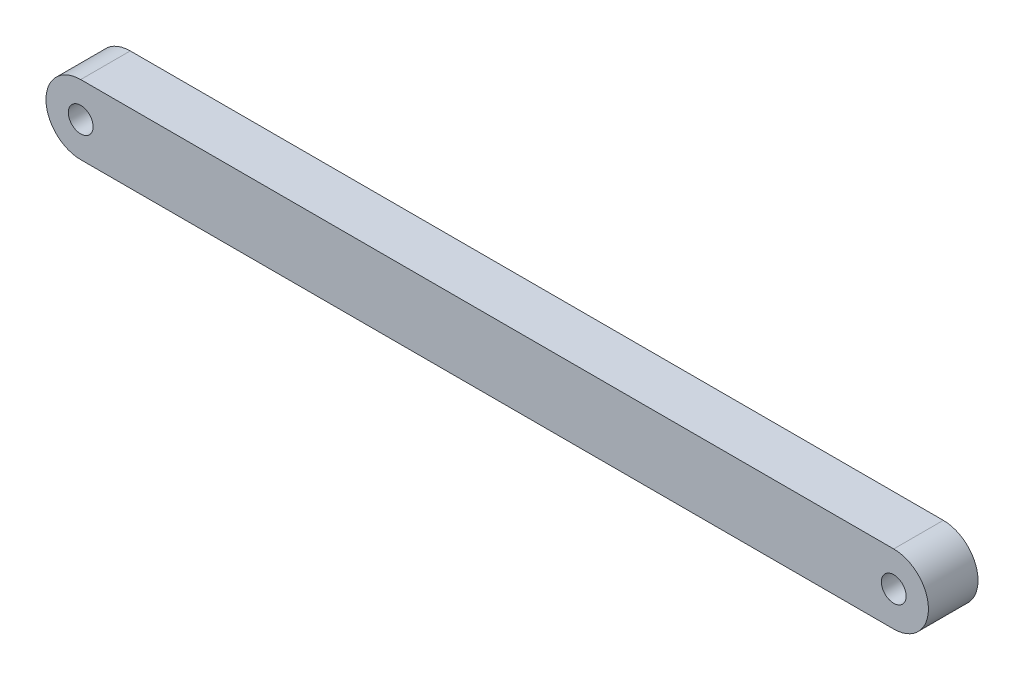
ISO-10303-21;
HEADER;
FILE_DESCRIPTION(('STEP AP214'),'2;1');
FILE_NAME('part.step','',(''),(''),'','','');
FILE_SCHEMA(('AUTOMOTIVE_DESIGN { 1 0 10303 214 1 1 1 1 }'));
ENDSEC;
DATA;
#1=APPLICATION_CONTEXT('core data for automotive mechanical design processes');
#2=APPLICATION_PROTOCOL_DEFINITION('international standard','automotive_design',2000,#1);
#3=PRODUCT_CONTEXT('',#1,'mechanical');
#4=PRODUCT('Part','Part','',(#3));
#5=PRODUCT_RELATED_PRODUCT_CATEGORY('part','',(#4));
#6=PRODUCT_DEFINITION_FORMATION('','',#4);
#7=PRODUCT_DEFINITION_CONTEXT('part definition',#1,'design');
#8=PRODUCT_DEFINITION('design','',#6,#7);
#9=PRODUCT_DEFINITION_SHAPE('','',#8);
#10=(LENGTH_UNIT() NAMED_UNIT(*) SI_UNIT(.MILLI.,.METRE.));
#11=(NAMED_UNIT(*) PLANE_ANGLE_UNIT() SI_UNIT($,.RADIAN.));
#12=(NAMED_UNIT(*) SI_UNIT($,.STERADIAN.) SOLID_ANGLE_UNIT());
#13=UNCERTAINTY_MEASURE_WITH_UNIT(LENGTH_MEASURE(1.E-05),#10,'distance_accuracy_value','');
#14=(GEOMETRIC_REPRESENTATION_CONTEXT(3) GLOBAL_UNCERTAINTY_ASSIGNED_CONTEXT((#13)) GLOBAL_UNIT_ASSIGNED_CONTEXT((#10,
#11,#12)) REPRESENTATION_CONTEXT('',''));
#15=CARTESIAN_POINT('',(0.,0.,0.));
#16=DIRECTION('',(0.,0.,1.));
#17=DIRECTION('',(1.,0.,0.));
#18=AXIS2_PLACEMENT_3D('',#15,#16,#17);
#19=CARTESIAN_POINT('',(0.,0.,5.));
#20=DIRECTION('',(0.,0.,1.));
#21=DIRECTION('',(1.,0.,0.));
#22=AXIS2_PLACEMENT_3D('',#19,#20,#21);
#23=PLANE('',#22);
#24=CARTESIAN_POINT('',(0.,0.,5.));
#25=DIRECTION('',(0.,0.,1.));
#26=DIRECTION('',(1.,0.,0.));
#27=AXIS2_PLACEMENT_3D('',#24,#25,#26);
#28=CIRCLE('',#27,2.5);
#29=CARTESIAN_POINT('',(2.5,0.,5.));
#30=VERTEX_POINT('',#29);
#31=EDGE_CURVE('E118',#30,#30,#28,.T.);
#32=ORIENTED_EDGE('',*,*,#31,.F.);
#33=EDGE_LOOP('',(#32));
#34=FACE_BOUND('',#33,.T.);
#35=CARTESIAN_POINT('',(0.,0.,5.));
#36=DIRECTION('',(0.,0.,1.));
#37=DIRECTION('',(1.,0.,0.));
#38=AXIS2_PLACEMENT_3D('',#35,#36,#37);
#39=CIRCLE('',#38,7.);
#40=CARTESIAN_POINT('',(0.,7.,5.));
#41=VERTEX_POINT('',#40);
#42=CARTESIAN_POINT('',(0.,-7.,5.));
#43=VERTEX_POINT('',#42);
#44=EDGE_CURVE('E98',#41,#43,#39,.T.);
#45=ORIENTED_EDGE('',*,*,#44,.T.);
#46=DIRECTION('',(1.,0.,0.));
#47=VECTOR('',#46,1.);
#48=CARTESIAN_POINT('',(0.,-7.,5.));
#49=LINE('',#48,#47);
#50=CARTESIAN_POINT('',(164.,-7.,5.));
#51=VERTEX_POINT('',#50);
#52=EDGE_CURVE('E93',#43,#51,#49,.T.);
#53=ORIENTED_EDGE('',*,*,#52,.T.);
#54=CARTESIAN_POINT('',(164.,0.,5.));
#55=DIRECTION('',(0.,0.,1.));
#56=DIRECTION('',(1.,0.,0.));
#57=AXIS2_PLACEMENT_3D('',#54,#55,#56);
#58=CIRCLE('',#57,7.);
#59=CARTESIAN_POINT('',(164.,7.,5.));
#60=VERTEX_POINT('',#59);
#61=EDGE_CURVE('E96',#51,#60,#58,.T.);
#62=ORIENTED_EDGE('',*,*,#61,.T.);
#63=DIRECTION('',(-1.,0.,0.));
#64=VECTOR('',#63,1.);
#65=CARTESIAN_POINT('',(0.,7.,5.));
#66=LINE('',#65,#64);
#67=EDGE_CURVE('E63',#60,#41,#66,.T.);
#68=ORIENTED_EDGE('',*,*,#67,.T.);
#69=EDGE_LOOP('',(#45,#53,#62,#68));
#70=FACE_BOUND('',#69,.T.);
#71=CARTESIAN_POINT('',(164.,0.,5.));
#72=DIRECTION('',(0.,0.,1.));
#73=DIRECTION('',(1.,0.,0.));
#74=AXIS2_PLACEMENT_3D('',#71,#72,#73);
#75=CIRCLE('',#74,2.5);
#76=CARTESIAN_POINT('',(166.5,0.,5.));
#77=VERTEX_POINT('',#76);
#78=EDGE_CURVE('E140',#77,#77,#75,.T.);
#79=ORIENTED_EDGE('',*,*,#78,.F.);
#80=EDGE_LOOP('',(#79));
#81=FACE_BOUND('',#80,.T.);
#82=ADVANCED_FACE('F45',(#34,#70,#81),#23,.T.);
#83=CARTESIAN_POINT('',(0.,0.,-5.));
#84=DIRECTION('',(0.,0.,1.));
#85=DIRECTION('',(1.,0.,0.));
#86=AXIS2_PLACEMENT_3D('',#83,#84,#85);
#87=PLANE('',#86);
#88=CARTESIAN_POINT('',(0.,0.,-5.));
#89=DIRECTION('',(0.,0.,1.));
#90=DIRECTION('',(1.,0.,0.));
#91=AXIS2_PLACEMENT_3D('',#88,#89,#90);
#92=CIRCLE('',#91,7.);
#93=CARTESIAN_POINT('',(0.,7.,-5.));
#94=VERTEX_POINT('',#93);
#95=CARTESIAN_POINT('',(0.,-7.,-5.));
#96=VERTEX_POINT('',#95);
#97=EDGE_CURVE('E114',#94,#96,#92,.T.);
#98=ORIENTED_EDGE('',*,*,#97,.F.);
#99=DIRECTION('',(-1.,0.,0.));
#100=VECTOR('',#99,1.);
#101=CARTESIAN_POINT('',(0.,7.,-5.));
#102=LINE('',#101,#100);
#103=CARTESIAN_POINT('',(164.,7.,-5.));
#104=VERTEX_POINT('',#103);
#105=EDGE_CURVE('E86',#104,#94,#102,.T.);
#106=ORIENTED_EDGE('',*,*,#105,.F.);
#107=CARTESIAN_POINT('',(164.,0.,-5.));
#108=DIRECTION('',(0.,0.,1.));
#109=DIRECTION('',(1.,0.,0.));
#110=AXIS2_PLACEMENT_3D('',#107,#108,#109);
#111=CIRCLE('',#110,7.);
#112=CARTESIAN_POINT('',(164.,-7.,-5.));
#113=VERTEX_POINT('',#112);
#114=EDGE_CURVE('E80',#113,#104,#111,.T.);
#115=ORIENTED_EDGE('',*,*,#114,.F.);
#116=DIRECTION('',(1.,0.,0.));
#117=VECTOR('',#116,1.);
#118=CARTESIAN_POINT('',(0.,-7.,-5.));
#119=LINE('',#118,#117);
#120=EDGE_CURVE('E103',#96,#113,#119,.T.);
#121=ORIENTED_EDGE('',*,*,#120,.F.);
#122=EDGE_LOOP('',(#98,#106,#115,#121));
#123=FACE_BOUND('',#122,.T.);
#124=CARTESIAN_POINT('',(0.,0.,-5.));
#125=DIRECTION('',(0.,0.,1.));
#126=DIRECTION('',(1.,0.,0.));
#127=AXIS2_PLACEMENT_3D('',#124,#125,#126);
#128=CIRCLE('',#127,2.5);
#129=CARTESIAN_POINT('',(2.5,0.,-5.));
#130=VERTEX_POINT('',#129);
#131=EDGE_CURVE('E136',#130,#130,#128,.T.);
#132=ORIENTED_EDGE('',*,*,#131,.T.);
#133=EDGE_LOOP('',(#132));
#134=FACE_BOUND('',#133,.T.);
#135=CARTESIAN_POINT('',(164.,0.,-5.));
#136=DIRECTION('',(0.,0.,1.));
#137=DIRECTION('',(1.,0.,0.));
#138=AXIS2_PLACEMENT_3D('',#135,#136,#137);
#139=CIRCLE('',#138,2.5);
#140=CARTESIAN_POINT('',(166.5,0.,-5.));
#141=VERTEX_POINT('',#140);
#142=EDGE_CURVE('E144',#141,#141,#139,.T.);
#143=ORIENTED_EDGE('',*,*,#142,.T.);
#144=EDGE_LOOP('',(#143));
#145=FACE_BOUND('',#144,.T.);
#146=ADVANCED_FACE('F131',(#123,#134,#145),#87,.F.);
#147=CARTESIAN_POINT('',(0.,0.,5.));
#148=DIRECTION('',(0.,0.,-1.));
#149=DIRECTION('',(-1.,0.,0.));
#150=AXIS2_PLACEMENT_3D('',#147,#148,#149);
#151=CYLINDRICAL_SURFACE('',#150,7.);
#152=ORIENTED_EDGE('',*,*,#97,.T.);
#153=DIRECTION('',(0.,0.,-1.));
#154=VECTOR('',#153,1.);
#155=CARTESIAN_POINT('',(0.,-7.,5.));
#156=LINE('',#155,#154);
#157=EDGE_CURVE('E11',#43,#96,#156,.T.);
#158=ORIENTED_EDGE('',*,*,#157,.F.);
#159=ORIENTED_EDGE('',*,*,#44,.F.);
#160=DIRECTION('',(0.,0.,-1.));
#161=VECTOR('',#160,1.);
#162=CARTESIAN_POINT('',(0.,7.,5.));
#163=LINE('',#162,#161);
#164=EDGE_CURVE('E110',#41,#94,#163,.T.);
#165=ORIENTED_EDGE('',*,*,#164,.T.);
#166=EDGE_LOOP('',(#152,#158,#159,#165));
#167=FACE_BOUND('',#166,.T.);
#168=ADVANCED_FACE('F47',(#167),#151,.T.);
#169=CARTESIAN_POINT('',(0.,-7.,5.));
#170=DIRECTION('',(0.,1.,0.));
#171=DIRECTION('',(0.,0.,1.));
#172=AXIS2_PLACEMENT_3D('',#169,#170,#171);
#173=PLANE('',#172);
#174=ORIENTED_EDGE('',*,*,#120,.T.);
#175=DIRECTION('',(0.,0.,-1.));
#176=VECTOR('',#175,1.);
#177=CARTESIAN_POINT('',(164.,-7.,5.));
#178=LINE('',#177,#176);
#179=EDGE_CURVE('E55',#51,#113,#178,.T.);
#180=ORIENTED_EDGE('',*,*,#179,.F.);
#181=ORIENTED_EDGE('',*,*,#52,.F.);
#182=ORIENTED_EDGE('',*,*,#157,.T.);
#183=EDGE_LOOP('',(#174,#180,#181,#182));
#184=FACE_BOUND('',#183,.T.);
#185=ADVANCED_FACE('F102',(#184),#173,.F.);
#186=CARTESIAN_POINT('',(164.,0.,5.));
#187=DIRECTION('',(0.,0.,-1.));
#188=DIRECTION('',(-1.,0.,0.));
#189=AXIS2_PLACEMENT_3D('',#186,#187,#188);
#190=CYLINDRICAL_SURFACE('',#189,7.);
#191=ORIENTED_EDGE('',*,*,#114,.T.);
#192=DIRECTION('',(0.,0.,-1.));
#193=VECTOR('',#192,1.);
#194=CARTESIAN_POINT('',(164.,7.,5.));
#195=LINE('',#194,#193);
#196=EDGE_CURVE('E105',#60,#104,#195,.T.);
#197=ORIENTED_EDGE('',*,*,#196,.F.);
#198=ORIENTED_EDGE('',*,*,#61,.F.);
#199=ORIENTED_EDGE('',*,*,#179,.T.);
#200=EDGE_LOOP('',(#191,#197,#198,#199));
#201=FACE_BOUND('',#200,.T.);
#202=ADVANCED_FACE('F106',(#201),#190,.T.);
#203=CARTESIAN_POINT('',(0.,7.,5.));
#204=DIRECTION('',(0.,-1.,0.));
#205=DIRECTION('',(0.,0.,-1.));
#206=AXIS2_PLACEMENT_3D('',#203,#204,#205);
#207=PLANE('',#206);
#208=ORIENTED_EDGE('',*,*,#105,.T.);
#209=ORIENTED_EDGE('',*,*,#164,.F.);
#210=ORIENTED_EDGE('',*,*,#67,.F.);
#211=ORIENTED_EDGE('',*,*,#196,.T.);
#212=EDGE_LOOP('',(#208,#209,#210,#211));
#213=FACE_BOUND('',#212,.T.);
#214=ADVANCED_FACE('F128',(#213),#207,.F.);
#215=CARTESIAN_POINT('',(0.,0.,5.));
#216=DIRECTION('',(0.,0.,-1.));
#217=DIRECTION('',(-1.,0.,0.));
#218=AXIS2_PLACEMENT_3D('',#215,#216,#217);
#219=CYLINDRICAL_SURFACE('',#218,2.5);
#220=ORIENTED_EDGE('',*,*,#31,.T.);
#221=EDGE_LOOP('',(#220));
#222=FACE_BOUND('',#221,.T.);
#223=ORIENTED_EDGE('',*,*,#131,.F.);
#224=EDGE_LOOP('',(#223));
#225=FACE_BOUND('',#224,.T.);
#226=ADVANCED_FACE('F163',(#222,#225),#219,.F.);
#227=CARTESIAN_POINT('',(164.,0.,5.));
#228=DIRECTION('',(0.,0.,-1.));
#229=DIRECTION('',(-1.,0.,0.));
#230=AXIS2_PLACEMENT_3D('',#227,#228,#229);
#231=CYLINDRICAL_SURFACE('',#230,2.5);
#232=ORIENTED_EDGE('',*,*,#78,.T.);
#233=EDGE_LOOP('',(#232));
#234=FACE_BOUND('',#233,.T.);
#235=ORIENTED_EDGE('',*,*,#142,.F.);
#236=EDGE_LOOP('',(#235));
#237=FACE_BOUND('',#236,.T.);
#238=ADVANCED_FACE('F152',(#234,#237),#231,.F.);
#239=CLOSED_SHELL('',(#82,#146,#168,#185,#202,#214,#226,#238));
#240=MANIFOLD_SOLID_BREP('B2',#239);
#241=ADVANCED_BREP_SHAPE_REPRESENTATION('',(#18,#240),#14);
#242=SHAPE_DEFINITION_REPRESENTATION(#9,#241);
ENDSEC;
END-ISO-10303-21;
